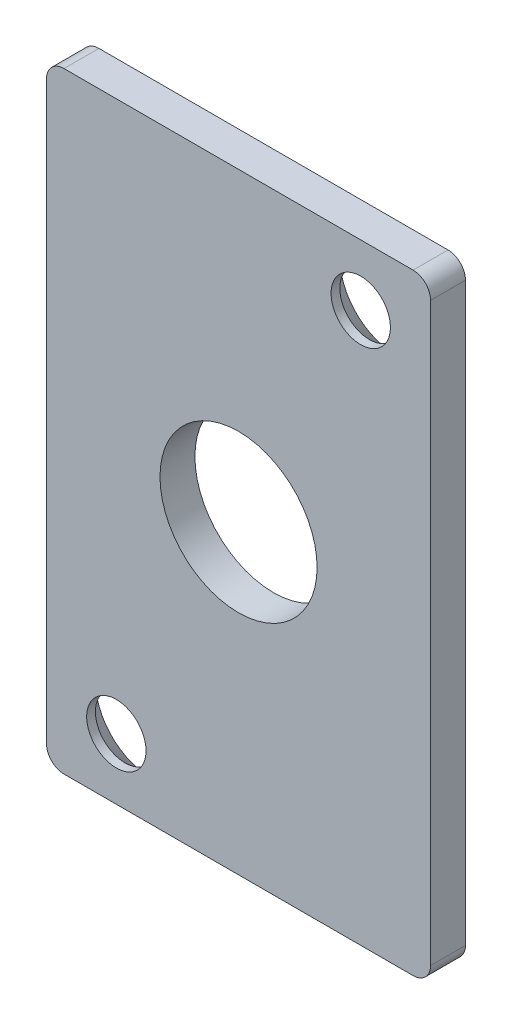
ISO-10303-21;
HEADER;
FILE_DESCRIPTION(('STEP AP214'),'2;1');
FILE_NAME('part.step','',(''),(''),'','','');
FILE_SCHEMA(('AUTOMOTIVE_DESIGN { 1 0 10303 214 1 1 1 1 }'));
ENDSEC;
DATA;
#1=APPLICATION_CONTEXT('core data for automotive mechanical design processes');
#2=APPLICATION_PROTOCOL_DEFINITION('international standard','automotive_design',2000,#1);
#3=PRODUCT_CONTEXT('',#1,'mechanical');
#4=PRODUCT('Part','Part','',(#3));
#5=PRODUCT_RELATED_PRODUCT_CATEGORY('part','',(#4));
#6=PRODUCT_DEFINITION_FORMATION('','',#4);
#7=PRODUCT_DEFINITION_CONTEXT('part definition',#1,'design');
#8=PRODUCT_DEFINITION('design','',#6,#7);
#9=PRODUCT_DEFINITION_SHAPE('','',#8);
#10=(LENGTH_UNIT() NAMED_UNIT(*) SI_UNIT(.MILLI.,.METRE.));
#11=(NAMED_UNIT(*) PLANE_ANGLE_UNIT() SI_UNIT($,.RADIAN.));
#12=(NAMED_UNIT(*) SI_UNIT($,.STERADIAN.) SOLID_ANGLE_UNIT());
#13=UNCERTAINTY_MEASURE_WITH_UNIT(LENGTH_MEASURE(1.E-05),#10,'distance_accuracy_value','');
#14=(GEOMETRIC_REPRESENTATION_CONTEXT(3) GLOBAL_UNCERTAINTY_ASSIGNED_CONTEXT((#13)) GLOBAL_UNIT_ASSIGNED_CONTEXT((#10,
#11,#12)) REPRESENTATION_CONTEXT('',''));
#15=CARTESIAN_POINT('',(0.,0.,0.));
#16=DIRECTION('',(0.,0.,1.));
#17=DIRECTION('',(1.,0.,0.));
#18=AXIS2_PLACEMENT_3D('',#15,#16,#17);
#19=CARTESIAN_POINT('',(1.13907958301551,0.950419527078566,-49.6));
#20=DIRECTION('',(0.,0.,-1.));
#21=DIRECTION('',(-1.,0.,0.));
#22=AXIS2_PLACEMENT_3D('',#19,#20,#21);
#23=PLANE('',#22);
#24=CARTESIAN_POINT('',(1.13907958301551,0.950419527078566,-49.6));
#25=DIRECTION('',(0.,0.,-1.));
#26=DIRECTION('',(-1.,0.,0.));
#27=AXIS2_PLACEMENT_3D('',#24,#25,#26);
#28=CIRCLE('',#27,0.95);
#29=CARTESIAN_POINT('',(0.189079583015513,0.950419527078566,-49.6));
#30=VERTEX_POINT('',#29);
#31=EDGE_CURVE('E21',#30,#30,#28,.F.);
#32=ORIENTED_EDGE('',*,*,#31,.F.);
#33=EDGE_LOOP('',(#32));
#34=FACE_BOUND('',#33,.T.);
#35=ADVANCED_FACE('F18',(#34),#23,.T.);
#36=CARTESIAN_POINT('',(-12.8609204169845,0.950419527078566,-49.6));
#37=DIRECTION('',(0.,0.,-1.));
#38=DIRECTION('',(-1.,0.,0.));
#39=AXIS2_PLACEMENT_3D('',#36,#37,#38);
#40=PLANE('',#39);
#41=CARTESIAN_POINT('',(-12.8609204169845,0.950419527078566,-49.6));
#42=DIRECTION('',(0.,0.,-1.));
#43=DIRECTION('',(-1.,0.,0.));
#44=AXIS2_PLACEMENT_3D('',#41,#42,#43);
#45=CIRCLE('',#44,0.95);
#46=CARTESIAN_POINT('',(-13.8109204169845,0.950419527078566,-49.6));
#47=VERTEX_POINT('',#46);
#48=EDGE_CURVE('E71',#47,#47,#45,.F.);
#49=ORIENTED_EDGE('',*,*,#48,.F.);
#50=EDGE_LOOP('',(#49));
#51=FACE_BOUND('',#50,.T.);
#52=ADVANCED_FACE('F172',(#51),#40,.T.);
#53=CARTESIAN_POINT('',(1.13907958301551,0.950419527078566,-49.6));
#54=DIRECTION('',(0.,0.,-1.));
#55=DIRECTION('',(-1.,0.,0.));
#56=AXIS2_PLACEMENT_3D('',#53,#54,#55);
#57=CYLINDRICAL_SURFACE('',#56,0.95);
#58=CARTESIAN_POINT('',(1.13907958301551,0.950419527078566,-49.));
#59=DIRECTION('',(0.,0.,-1.));
#60=DIRECTION('',(-1.,0.,0.));
#61=AXIS2_PLACEMENT_3D('',#58,#59,#60);
#62=CIRCLE('',#61,0.95);
#63=CARTESIAN_POINT('',(0.189079583015513,0.950419527078566,-49.));
#64=VERTEX_POINT('',#63);
#65=EDGE_CURVE('E145',#64,#64,#62,.F.);
#66=ORIENTED_EDGE('',*,*,#65,.F.);
#67=EDGE_LOOP('',(#66));
#68=FACE_BOUND('',#67,.T.);
#69=ORIENTED_EDGE('',*,*,#31,.T.);
#70=EDGE_LOOP('',(#69));
#71=FACE_BOUND('',#70,.T.);
#72=ADVANCED_FACE('F169',(#68,#71),#57,.T.);
#73=CARTESIAN_POINT('',(-12.8609204169845,0.950419527078566,-49.6));
#74=DIRECTION('',(0.,0.,-1.));
#75=DIRECTION('',(-1.,0.,0.));
#76=AXIS2_PLACEMENT_3D('',#73,#74,#75);
#77=CYLINDRICAL_SURFACE('',#76,0.95);
#78=CARTESIAN_POINT('',(-12.8609204169845,0.950419527078566,-49.));
#79=DIRECTION('',(0.,0.,-1.));
#80=DIRECTION('',(-1.,0.,0.));
#81=AXIS2_PLACEMENT_3D('',#78,#79,#80);
#82=CIRCLE('',#81,0.95);
#83=CARTESIAN_POINT('',(-13.8109204169845,0.950419527078566,-49.));
#84=VERTEX_POINT('',#83);
#85=EDGE_CURVE('E142',#84,#84,#82,.F.);
#86=ORIENTED_EDGE('',*,*,#85,.F.);
#87=EDGE_LOOP('',(#86));
#88=FACE_BOUND('',#87,.T.);
#89=ORIENTED_EDGE('',*,*,#48,.T.);
#90=EDGE_LOOP('',(#89));
#91=FACE_BOUND('',#90,.T.);
#92=ADVANCED_FACE('F237',(#88,#91),#77,.T.);
#93=CARTESIAN_POINT('',(-15.8609204169845,17.4504195270786,-49.));
#94=DIRECTION('',(0.,0.,-1.));
#95=DIRECTION('',(-1.,0.,0.));
#96=AXIS2_PLACEMENT_3D('',#93,#94,#95);
#97=CYLINDRICAL_SURFACE('',#96,1.);
#98=CARTESIAN_POINT('',(-15.8609204169845,17.4504195270786,-49.));
#99=DIRECTION('',(0.,0.,-1.));
#100=DIRECTION('',(-1.,0.,0.));
#101=AXIS2_PLACEMENT_3D('',#98,#99,#100);
#102=CIRCLE('',#101,1.);
#103=CARTESIAN_POINT('',(-16.8609204169845,17.4504195270786,-49.));
#104=VERTEX_POINT('',#103);
#105=CARTESIAN_POINT('',(-15.8609204169845,18.4504195270786,-49.));
#106=VERTEX_POINT('',#105);
#107=EDGE_CURVE('E151',#104,#106,#102,.T.);
#108=ORIENTED_EDGE('',*,*,#107,.F.);
#109=DIRECTION('',(0.,0.,1.));
#110=VECTOR('',#109,1.);
#111=CARTESIAN_POINT('',(-16.8609204169845,17.4504195270786,-49.));
#112=LINE('',#111,#110);
#113=CARTESIAN_POINT('',(-16.8609204169845,17.4504195270786,-47.));
#114=VERTEX_POINT('',#113);
#115=EDGE_CURVE('E68',#114,#104,#112,.F.);
#116=ORIENTED_EDGE('',*,*,#115,.F.);
#117=CARTESIAN_POINT('',(-15.8609204169845,17.4504195270786,-47.));
#118=DIRECTION('',(0.,0.,-1.));
#119=DIRECTION('',(-1.,0.,0.));
#120=AXIS2_PLACEMENT_3D('',#117,#118,#119);
#121=CIRCLE('',#120,1.);
#122=CARTESIAN_POINT('',(-15.8609204169845,18.4504195270786,-47.));
#123=VERTEX_POINT('',#122);
#124=EDGE_CURVE('E58',#114,#123,#121,.T.);
#125=ORIENTED_EDGE('',*,*,#124,.T.);
#126=DIRECTION('',(0.,0.,1.));
#127=VECTOR('',#126,1.);
#128=CARTESIAN_POINT('',(-15.8609204169845,18.4504195270786,-49.));
#129=LINE('',#128,#127);
#130=EDGE_CURVE('E66',#106,#123,#129,.T.);
#131=ORIENTED_EDGE('',*,*,#130,.F.);
#132=EDGE_LOOP('',(#108,#116,#125,#131));
#133=FACE_BOUND('',#132,.T.);
#134=ADVANCED_FACE('F64',(#133),#97,.T.);
#135=CARTESIAN_POINT('',(4.13907958301551,17.4504195270786,-49.));
#136=DIRECTION('',(0.,0.,-1.));
#137=DIRECTION('',(-1.,0.,0.));
#138=AXIS2_PLACEMENT_3D('',#135,#136,#137);
#139=CYLINDRICAL_SURFACE('',#138,1.);
#140=CARTESIAN_POINT('',(4.13907958301551,17.4504195270786,-49.));
#141=DIRECTION('',(0.,0.,-1.));
#142=DIRECTION('',(-1.,0.,0.));
#143=AXIS2_PLACEMENT_3D('',#140,#141,#142);
#144=CIRCLE('',#143,1.);
#145=CARTESIAN_POINT('',(4.13907958301551,18.4504195270786,-49.));
#146=VERTEX_POINT('',#145);
#147=CARTESIAN_POINT('',(5.13907958301551,17.4504195270786,-49.));
#148=VERTEX_POINT('',#147);
#149=EDGE_CURVE('E148',#146,#148,#144,.T.);
#150=ORIENTED_EDGE('',*,*,#149,.F.);
#151=DIRECTION('',(0.,0.,1.));
#152=VECTOR('',#151,1.);
#153=CARTESIAN_POINT('',(4.13907958301551,18.4504195270786,-49.));
#154=LINE('',#153,#152);
#155=CARTESIAN_POINT('',(4.13907958301551,18.4504195270786,-47.));
#156=VERTEX_POINT('',#155);
#157=EDGE_CURVE('E110',#156,#146,#154,.F.);
#158=ORIENTED_EDGE('',*,*,#157,.F.);
#159=CARTESIAN_POINT('',(4.13907958301551,17.4504195270786,-47.));
#160=DIRECTION('',(0.,0.,-1.));
#161=DIRECTION('',(-1.,0.,0.));
#162=AXIS2_PLACEMENT_3D('',#159,#160,#161);
#163=CIRCLE('',#162,1.);
#164=CARTESIAN_POINT('',(5.13907958301551,17.4504195270786,-47.));
#165=VERTEX_POINT('',#164);
#166=EDGE_CURVE('E70',#156,#165,#163,.T.);
#167=ORIENTED_EDGE('',*,*,#166,.T.);
#168=DIRECTION('',(0.,0.,1.));
#169=VECTOR('',#168,1.);
#170=CARTESIAN_POINT('',(5.13907958301551,17.4504195270786,-49.));
#171=LINE('',#170,#169);
#172=EDGE_CURVE('E104',#148,#165,#171,.T.);
#173=ORIENTED_EDGE('',*,*,#172,.F.);
#174=EDGE_LOOP('',(#150,#158,#167,#173));
#175=FACE_BOUND('',#174,.T.);
#176=ADVANCED_FACE('F230',(#175),#139,.T.);
#177=CARTESIAN_POINT('',(4.13907958301551,-15.5495804729214,-49.));
#178=DIRECTION('',(0.,0.,-1.));
#179=DIRECTION('',(-1.,0.,0.));
#180=AXIS2_PLACEMENT_3D('',#177,#178,#179);
#181=CYLINDRICAL_SURFACE('',#180,1.);
#182=CARTESIAN_POINT('',(4.13907958301551,-15.5495804729214,-49.));
#183=DIRECTION('',(0.,0.,-1.));
#184=DIRECTION('',(-1.,0.,0.));
#185=AXIS2_PLACEMENT_3D('',#182,#183,#184);
#186=CIRCLE('',#185,1.);
#187=CARTESIAN_POINT('',(5.13907958301551,-15.5495804729214,-49.));
#188=VERTEX_POINT('',#187);
#189=CARTESIAN_POINT('',(4.13907958301551,-16.5495804729214,-49.));
#190=VERTEX_POINT('',#189);
#191=EDGE_CURVE('E157',#188,#190,#186,.T.);
#192=ORIENTED_EDGE('',*,*,#191,.F.);
#193=DIRECTION('',(0.,0.,1.));
#194=VECTOR('',#193,1.);
#195=CARTESIAN_POINT('',(5.13907958301551,-15.5495804729214,-49.));
#196=LINE('',#195,#194);
#197=CARTESIAN_POINT('',(5.13907958301551,-15.5495804729214,-47.));
#198=VERTEX_POINT('',#197);
#199=EDGE_CURVE('E107',#198,#188,#196,.F.);
#200=ORIENTED_EDGE('',*,*,#199,.F.);
#201=CARTESIAN_POINT('',(4.13907958301551,-15.5495804729214,-47.));
#202=DIRECTION('',(0.,0.,-1.));
#203=DIRECTION('',(-1.,0.,0.));
#204=AXIS2_PLACEMENT_3D('',#201,#202,#203);
#205=CIRCLE('',#204,1.);
#206=CARTESIAN_POINT('',(4.13907958301551,-16.5495804729214,-47.));
#207=VERTEX_POINT('',#206);
#208=EDGE_CURVE('E161',#198,#207,#205,.T.);
#209=ORIENTED_EDGE('',*,*,#208,.T.);
#210=DIRECTION('',(0.,0.,1.));
#211=VECTOR('',#210,1.);
#212=CARTESIAN_POINT('',(4.13907958301551,-16.5495804729214,-49.));
#213=LINE('',#212,#211);
#214=EDGE_CURVE('E96',#190,#207,#213,.T.);
#215=ORIENTED_EDGE('',*,*,#214,.F.);
#216=EDGE_LOOP('',(#192,#200,#209,#215));
#217=FACE_BOUND('',#216,.T.);
#218=ADVANCED_FACE('F226',(#217),#181,.T.);
#219=CARTESIAN_POINT('',(-15.8609204169845,-15.5495804729214,-49.));
#220=DIRECTION('',(0.,0.,-1.));
#221=DIRECTION('',(-1.,0.,0.));
#222=AXIS2_PLACEMENT_3D('',#219,#220,#221);
#223=CYLINDRICAL_SURFACE('',#222,1.);
#224=CARTESIAN_POINT('',(-15.8609204169845,-15.5495804729214,-49.));
#225=DIRECTION('',(0.,0.,-1.));
#226=DIRECTION('',(-1.,0.,0.));
#227=AXIS2_PLACEMENT_3D('',#224,#225,#226);
#228=CIRCLE('',#227,1.);
#229=CARTESIAN_POINT('',(-15.8609204169845,-16.5495804729214,-49.));
#230=VERTEX_POINT('',#229);
#231=CARTESIAN_POINT('',(-16.8609204169845,-15.5495804729214,-49.));
#232=VERTEX_POINT('',#231);
#233=EDGE_CURVE('E154',#230,#232,#228,.T.);
#234=ORIENTED_EDGE('',*,*,#233,.F.);
#235=DIRECTION('',(0.,0.,1.));
#236=VECTOR('',#235,1.);
#237=CARTESIAN_POINT('',(-15.8609204169845,-16.5495804729214,-49.));
#238=LINE('',#237,#236);
#239=CARTESIAN_POINT('',(-15.8609204169845,-16.5495804729214,-47.));
#240=VERTEX_POINT('',#239);
#241=EDGE_CURVE('E99',#240,#230,#238,.F.);
#242=ORIENTED_EDGE('',*,*,#241,.F.);
#243=CARTESIAN_POINT('',(-15.8609204169845,-15.5495804729214,-47.));
#244=DIRECTION('',(0.,0.,-1.));
#245=DIRECTION('',(-1.,0.,0.));
#246=AXIS2_PLACEMENT_3D('',#243,#244,#245);
#247=CIRCLE('',#246,1.);
#248=CARTESIAN_POINT('',(-16.8609204169845,-15.5495804729214,-47.));
#249=VERTEX_POINT('',#248);
#250=EDGE_CURVE('E36',#240,#249,#247,.T.);
#251=ORIENTED_EDGE('',*,*,#250,.T.);
#252=DIRECTION('',(0.,0.,1.));
#253=VECTOR('',#252,1.);
#254=CARTESIAN_POINT('',(-16.8609204169845,-15.5495804729214,-49.));
#255=LINE('',#254,#253);
#256=EDGE_CURVE('E112',#232,#249,#255,.T.);
#257=ORIENTED_EDGE('',*,*,#256,.F.);
#258=EDGE_LOOP('',(#234,#242,#251,#257));
#259=FACE_BOUND('',#258,.T.);
#260=ADVANCED_FACE('F222',(#259),#223,.T.);
#261=CARTESIAN_POINT('',(-5.86092041698449,0.950419527078566,-49.));
#262=DIRECTION('',(0.,0.,-1.));
#263=DIRECTION('',(-1.,0.,0.));
#264=AXIS2_PLACEMENT_3D('',#261,#262,#263);
#265=PLANE('',#264);
#266=ORIENTED_EDGE('',*,*,#85,.T.);
#267=EDGE_LOOP('',(#266));
#268=FACE_BOUND('',#267,.T.);
#269=CARTESIAN_POINT('',(1.13907958301551,14.9504195270786,-48.9999999999213));
#270=DIRECTION('',(0.,0.,-1.));
#271=DIRECTION('',(-1.,0.,0.));
#272=AXIS2_PLACEMENT_3D('',#269,#270,#271);
#273=CIRCLE('',#272,3.1999999999246);
#274=CARTESIAN_POINT('',(-2.06092041690908,14.9504195270786,-48.9999999999213));
#275=VERTEX_POINT('',#274);
#276=EDGE_CURVE('E117',#275,#275,#273,.F.);
#277=ORIENTED_EDGE('',*,*,#276,.T.);
#278=EDGE_LOOP('',(#277));
#279=FACE_BOUND('',#278,.T.);
#280=CARTESIAN_POINT('',(-12.8609204169845,-13.0495804729214,-49.000000000035));
#281=DIRECTION('',(0.,0.,-1.));
#282=DIRECTION('',(-1.,0.,0.));
#283=AXIS2_PLACEMENT_3D('',#280,#281,#282);
#284=CIRCLE('',#283,3.1999999999346);
#285=CARTESIAN_POINT('',(-16.0609204169191,-13.0495804729214,-49.000000000035));
#286=VERTEX_POINT('',#285);
#287=EDGE_CURVE('E139',#286,#286,#284,.F.);
#288=ORIENTED_EDGE('',*,*,#287,.T.);
#289=EDGE_LOOP('',(#288));
#290=FACE_BOUND('',#289,.T.);
#291=CARTESIAN_POINT('',(-5.86092041698449,0.950419527078566,-49.));
#292=DIRECTION('',(0.,0.,-1.));
#293=DIRECTION('',(-1.,0.,0.));
#294=AXIS2_PLACEMENT_3D('',#291,#292,#293);
#295=CIRCLE('',#294,4.5);
#296=CARTESIAN_POINT('',(-10.3609204169845,0.950419527078566,-49.));
#297=VERTEX_POINT('',#296);
#298=EDGE_CURVE('E103',#297,#297,#295,.F.);
#299=ORIENTED_EDGE('',*,*,#298,.T.);
#300=EDGE_LOOP('',(#299));
#301=FACE_BOUND('',#300,.T.);
#302=ORIENTED_EDGE('',*,*,#65,.T.);
#303=EDGE_LOOP('',(#302));
#304=FACE_BOUND('',#303,.T.);
#305=DIRECTION('',(1.,0.,0.));
#306=VECTOR('',#305,1.);
#307=CARTESIAN_POINT('',(-16.8609204169845,18.4504195270786,-49.));
#308=LINE('',#307,#306);
#309=EDGE_CURVE('E80',#146,#106,#308,.F.);
#310=ORIENTED_EDGE('',*,*,#309,.F.);
#311=ORIENTED_EDGE('',*,*,#149,.T.);
#312=DIRECTION('',(0.,1.,0.));
#313=VECTOR('',#312,1.);
#314=CARTESIAN_POINT('',(5.13907958301551,18.4504195270786,-49.));
#315=LINE('',#314,#313);
#316=EDGE_CURVE('E81',#188,#148,#315,.T.);
#317=ORIENTED_EDGE('',*,*,#316,.F.);
#318=ORIENTED_EDGE('',*,*,#191,.T.);
#319=DIRECTION('',(1.,0.,0.));
#320=VECTOR('',#319,1.);
#321=CARTESIAN_POINT('',(5.13907958301552,-16.5495804729214,-49.));
#322=LINE('',#321,#320);
#323=EDGE_CURVE('E100',#230,#190,#322,.T.);
#324=ORIENTED_EDGE('',*,*,#323,.F.);
#325=ORIENTED_EDGE('',*,*,#233,.T.);
#326=DIRECTION('',(0.,1.,0.));
#327=VECTOR('',#326,1.);
#328=CARTESIAN_POINT('',(-16.8609204169845,-16.5495804729214,-49.));
#329=LINE('',#328,#327);
#330=EDGE_CURVE('E115',#104,#232,#329,.F.);
#331=ORIENTED_EDGE('',*,*,#330,.F.);
#332=ORIENTED_EDGE('',*,*,#107,.T.);
#333=EDGE_LOOP('',(#310,#311,#317,#318,#324,#325,#331,#332));
#334=FACE_BOUND('',#333,.T.);
#335=ADVANCED_FACE('F218',(#268,#279,#290,#301,#304,#334),#265,.T.);
#336=CARTESIAN_POINT('',(-12.8609204169845,-13.0495804729214,-48.9999999999782));
#337=DIRECTION('',(0.,0.,-1.));
#338=DIRECTION('',(-1.,0.,0.));
#339=AXIS2_PLACEMENT_3D('',#336,#337,#338);
#340=CONICAL_SURFACE('',#339,3.19999999987776,0.785398163416396);
#341=ORIENTED_EDGE('',*,*,#287,.F.);
#342=EDGE_LOOP('',(#341));
#343=FACE_BOUND('',#342,.T.);
#344=CARTESIAN_POINT('',(-12.8609204169845,-13.0495804729214,-47.5));
#345=DIRECTION('',(0.,0.,1.));
#346=DIRECTION('',(1.,0.,0.));
#347=AXIS2_PLACEMENT_3D('',#344,#345,#346);
#348=CIRCLE('',#347,1.69999999999999);
#349=CARTESIAN_POINT('',(-11.1609204169845,-13.0495804729214,-47.5));
#350=VERTEX_POINT('',#349);
#351=EDGE_CURVE('E120',#350,#350,#348,.T.);
#352=ORIENTED_EDGE('',*,*,#351,.T.);
#353=EDGE_LOOP('',(#352));
#354=FACE_BOUND('',#353,.T.);
#355=ADVANCED_FACE('F214',(#343,#354),#340,.F.);
#356=CARTESIAN_POINT('',(1.13907958301551,14.9504195270786,-48.9999999999213));
#357=DIRECTION('',(0.,0.,-1.));
#358=DIRECTION('',(-1.,0.,0.));
#359=AXIS2_PLACEMENT_3D('',#356,#357,#358);
#360=CONICAL_SURFACE('',#359,3.1999999999246,0.785398163397448);
#361=ORIENTED_EDGE('',*,*,#276,.F.);
#362=EDGE_LOOP('',(#361));
#363=FACE_BOUND('',#362,.T.);
#364=CARTESIAN_POINT('',(1.13907958301551,14.9504195270786,-47.5));
#365=DIRECTION('',(0.,0.,1.));
#366=DIRECTION('',(1.,0.,0.));
#367=AXIS2_PLACEMENT_3D('',#364,#365,#366);
#368=CIRCLE('',#367,1.69999999999999);
#369=CARTESIAN_POINT('',(2.83907958301551,14.9504195270786,-47.5));
#370=VERTEX_POINT('',#369);
#371=EDGE_CURVE('E92',#370,#370,#368,.T.);
#372=ORIENTED_EDGE('',*,*,#371,.T.);
#373=EDGE_LOOP('',(#372));
#374=FACE_BOUND('',#373,.T.);
#375=ADVANCED_FACE('F210',(#363,#374),#360,.F.);
#376=CARTESIAN_POINT('',(-16.8609204169845,-16.5495804729214,-49.));
#377=DIRECTION('',(-1.,0.,0.));
#378=DIRECTION('',(0.,0.,1.));
#379=AXIS2_PLACEMENT_3D('',#376,#377,#378);
#380=PLANE('',#379);
#381=ORIENTED_EDGE('',*,*,#330,.T.);
#382=ORIENTED_EDGE('',*,*,#256,.T.);
#383=DIRECTION('',(0.,1.,0.));
#384=VECTOR('',#383,1.);
#385=CARTESIAN_POINT('',(-16.8609204169845,0.950419527078566,-47.));
#386=LINE('',#385,#384);
#387=EDGE_CURVE('E87',#249,#114,#386,.T.);
#388=ORIENTED_EDGE('',*,*,#387,.T.);
#389=ORIENTED_EDGE('',*,*,#115,.T.);
#390=EDGE_LOOP('',(#381,#382,#388,#389));
#391=FACE_BOUND('',#390,.T.);
#392=ADVANCED_FACE('F207',(#391),#380,.T.);
#393=CARTESIAN_POINT('',(-16.8609204169845,18.4504195270786,-49.));
#394=DIRECTION('',(0.,1.,0.));
#395=DIRECTION('',(0.,0.,1.));
#396=AXIS2_PLACEMENT_3D('',#393,#394,#395);
#397=PLANE('',#396);
#398=ORIENTED_EDGE('',*,*,#309,.T.);
#399=ORIENTED_EDGE('',*,*,#130,.T.);
#400=DIRECTION('',(-1.,0.,0.));
#401=VECTOR('',#400,1.);
#402=CARTESIAN_POINT('',(-5.86092041698449,18.4504195270786,-47.));
#403=LINE('',#402,#401);
#404=EDGE_CURVE('E78',#123,#156,#403,.F.);
#405=ORIENTED_EDGE('',*,*,#404,.T.);
#406=ORIENTED_EDGE('',*,*,#157,.T.);
#407=EDGE_LOOP('',(#398,#399,#405,#406));
#408=FACE_BOUND('',#407,.T.);
#409=ADVANCED_FACE('F76',(#408),#397,.T.);
#410=CARTESIAN_POINT('',(5.13907958301551,18.4504195270786,-49.));
#411=DIRECTION('',(1.,0.,0.));
#412=DIRECTION('',(0.,1.,0.));
#413=AXIS2_PLACEMENT_3D('',#410,#411,#412);
#414=PLANE('',#413);
#415=DIRECTION('',(0.,1.,0.));
#416=VECTOR('',#415,1.);
#417=CARTESIAN_POINT('',(5.13907958301551,0.950419527078566,-47.));
#418=LINE('',#417,#416);
#419=EDGE_CURVE('E86',#165,#198,#418,.F.);
#420=ORIENTED_EDGE('',*,*,#419,.T.);
#421=ORIENTED_EDGE('',*,*,#199,.T.);
#422=ORIENTED_EDGE('',*,*,#316,.T.);
#423=ORIENTED_EDGE('',*,*,#172,.T.);
#424=EDGE_LOOP('',(#420,#421,#422,#423));
#425=FACE_BOUND('',#424,.T.);
#426=ADVANCED_FACE('F200',(#425),#414,.T.);
#427=CARTESIAN_POINT('',(5.13907958301552,-16.5495804729214,-49.));
#428=DIRECTION('',(0.,-1.,0.));
#429=DIRECTION('',(1.,0.,0.));
#430=AXIS2_PLACEMENT_3D('',#427,#428,#429);
#431=PLANE('',#430);
#432=DIRECTION('',(-1.,0.,0.));
#433=VECTOR('',#432,1.);
#434=CARTESIAN_POINT('',(-5.86092041698449,-16.5495804729214,-47.));
#435=LINE('',#434,#433);
#436=EDGE_CURVE('E90',#207,#240,#435,.T.);
#437=ORIENTED_EDGE('',*,*,#436,.T.);
#438=ORIENTED_EDGE('',*,*,#241,.T.);
#439=ORIENTED_EDGE('',*,*,#323,.T.);
#440=ORIENTED_EDGE('',*,*,#214,.T.);
#441=EDGE_LOOP('',(#437,#438,#439,#440));
#442=FACE_BOUND('',#441,.T.);
#443=ADVANCED_FACE('F196',(#442),#431,.T.);
#444=CARTESIAN_POINT('',(-5.86092041698449,0.950419527078566,-49.));
#445=DIRECTION('',(0.,0.,-1.));
#446=DIRECTION('',(-1.,0.,0.));
#447=AXIS2_PLACEMENT_3D('',#444,#445,#446);
#448=CYLINDRICAL_SURFACE('',#447,4.5);
#449=CARTESIAN_POINT('',(-5.86092041698449,0.950419527078566,-47.));
#450=DIRECTION('',(0.,0.,-1.));
#451=DIRECTION('',(-1.,0.,0.));
#452=AXIS2_PLACEMENT_3D('',#449,#450,#451);
#453=CIRCLE('',#452,4.5);
#454=CARTESIAN_POINT('',(-10.3609204169845,0.950419527078566,-47.));
#455=VERTEX_POINT('',#454);
#456=EDGE_CURVE('E132',#455,#455,#453,.F.);
#457=ORIENTED_EDGE('',*,*,#456,.T.);
#458=EDGE_LOOP('',(#457));
#459=FACE_BOUND('',#458,.T.);
#460=ORIENTED_EDGE('',*,*,#298,.F.);
#461=EDGE_LOOP('',(#460));
#462=FACE_BOUND('',#461,.T.);
#463=ADVANCED_FACE('F192',(#459,#462),#448,.F.);
#464=CARTESIAN_POINT('',(-12.8609204169845,-13.0495804729214,-49.));
#465=DIRECTION('',(0.,0.,1.));
#466=DIRECTION('',(1.,0.,0.));
#467=AXIS2_PLACEMENT_3D('',#464,#465,#466);
#468=CYLINDRICAL_SURFACE('',#467,1.69999999999999);
#469=ORIENTED_EDGE('',*,*,#351,.F.);
#470=EDGE_LOOP('',(#469));
#471=FACE_BOUND('',#470,.T.);
#472=CARTESIAN_POINT('',(-12.8609204169845,-13.0495804729214,-47.));
#473=DIRECTION('',(0.,0.,1.));
#474=DIRECTION('',(1.,0.,0.));
#475=AXIS2_PLACEMENT_3D('',#472,#473,#474);
#476=CIRCLE('',#475,1.69999999999999);
#477=CARTESIAN_POINT('',(-11.1609204169845,-13.0495804729214,-47.));
#478=VERTEX_POINT('',#477);
#479=EDGE_CURVE('E27',#478,#478,#476,.T.);
#480=ORIENTED_EDGE('',*,*,#479,.T.);
#481=EDGE_LOOP('',(#480));
#482=FACE_BOUND('',#481,.T.);
#483=ADVANCED_FACE('F184',(#471,#482),#468,.F.);
#484=CARTESIAN_POINT('',(1.13907958301551,14.9504195270786,-49.));
#485=DIRECTION('',(0.,0.,1.));
#486=DIRECTION('',(1.,0.,0.));
#487=AXIS2_PLACEMENT_3D('',#484,#485,#486);
#488=CYLINDRICAL_SURFACE('',#487,1.69999999999999);
#489=ORIENTED_EDGE('',*,*,#371,.F.);
#490=EDGE_LOOP('',(#489));
#491=FACE_BOUND('',#490,.T.);
#492=CARTESIAN_POINT('',(1.13907958301551,14.9504195270786,-47.));
#493=DIRECTION('',(0.,0.,1.));
#494=DIRECTION('',(1.,0.,0.));
#495=AXIS2_PLACEMENT_3D('',#492,#493,#494);
#496=CIRCLE('',#495,1.69999999999999);
#497=CARTESIAN_POINT('',(2.83907958301551,14.9504195270786,-47.));
#498=VERTEX_POINT('',#497);
#499=EDGE_CURVE('E11',#498,#498,#496,.T.);
#500=ORIENTED_EDGE('',*,*,#499,.T.);
#501=EDGE_LOOP('',(#500));
#502=FACE_BOUND('',#501,.T.);
#503=ADVANCED_FACE('F179',(#491,#502),#488,.F.);
#504=CARTESIAN_POINT('',(-5.86092041698449,0.950419527078566,-47.));
#505=DIRECTION('',(0.,0.,-1.));
#506=DIRECTION('',(-1.,0.,0.));
#507=AXIS2_PLACEMENT_3D('',#504,#505,#506);
#508=PLANE('',#507);
#509=ORIENTED_EDGE('',*,*,#499,.F.);
#510=EDGE_LOOP('',(#509));
#511=FACE_BOUND('',#510,.T.);
#512=ORIENTED_EDGE('',*,*,#479,.F.);
#513=EDGE_LOOP('',(#512));
#514=FACE_BOUND('',#513,.T.);
#515=ORIENTED_EDGE('',*,*,#456,.F.);
#516=EDGE_LOOP('',(#515));
#517=FACE_BOUND('',#516,.T.);
#518=ORIENTED_EDGE('',*,*,#436,.F.);
#519=ORIENTED_EDGE('',*,*,#208,.F.);
#520=ORIENTED_EDGE('',*,*,#419,.F.);
#521=ORIENTED_EDGE('',*,*,#166,.F.);
#522=ORIENTED_EDGE('',*,*,#404,.F.);
#523=ORIENTED_EDGE('',*,*,#124,.F.);
#524=ORIENTED_EDGE('',*,*,#387,.F.);
#525=ORIENTED_EDGE('',*,*,#250,.F.);
#526=EDGE_LOOP('',(#518,#519,#520,#521,#522,#523,#524,#525));
#527=FACE_BOUND('',#526,.T.);
#528=ADVANCED_FACE('F83',(#511,#514,#517,#527),#508,.F.);
#529=CLOSED_SHELL('',(#35,#52,#72,#92,#134,#176,#218,#260,#335,#355,#375,#392,#409,#426,#443,
#463,#483,#503,#528));
#530=MANIFOLD_SOLID_BREP('B1',#529);
#531=ADVANCED_BREP_SHAPE_REPRESENTATION('',(#18,#530),#14);
#532=SHAPE_DEFINITION_REPRESENTATION(#9,#531);
ENDSEC;
END-ISO-10303-21;
